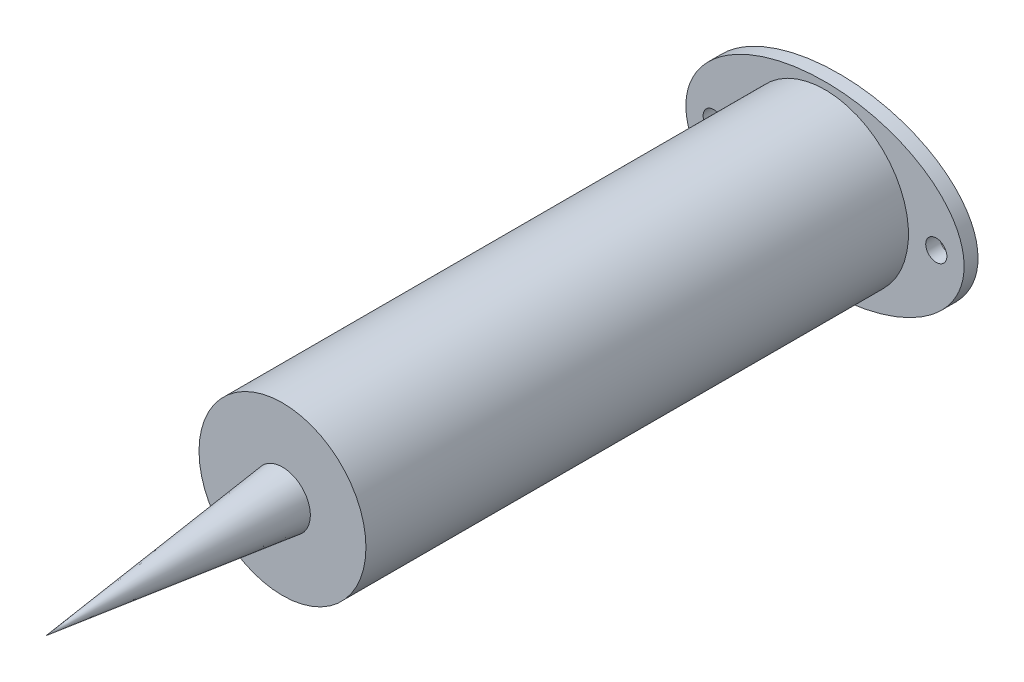
ISO-10303-21;
HEADER;
FILE_DESCRIPTION(('STEP AP214'),'2;1');
FILE_NAME('part.step','',(''),(''),'','','');
FILE_SCHEMA(('AUTOMOTIVE_DESIGN { 1 0 10303 214 1 1 1 1 }'));
ENDSEC;
DATA;
#1=APPLICATION_CONTEXT('core data for automotive mechanical design processes');
#2=APPLICATION_PROTOCOL_DEFINITION('international standard','automotive_design',2000,#1);
#3=PRODUCT_CONTEXT('',#1,'mechanical');
#4=PRODUCT('Part','Part','',(#3));
#5=PRODUCT_RELATED_PRODUCT_CATEGORY('part','',(#4));
#6=PRODUCT_DEFINITION_FORMATION('','',#4);
#7=PRODUCT_DEFINITION_CONTEXT('part definition',#1,'design');
#8=PRODUCT_DEFINITION('design','',#6,#7);
#9=PRODUCT_DEFINITION_SHAPE('','',#8);
#10=(LENGTH_UNIT() NAMED_UNIT(*) SI_UNIT(.MILLI.,.METRE.));
#11=(NAMED_UNIT(*) PLANE_ANGLE_UNIT() SI_UNIT($,.RADIAN.));
#12=(NAMED_UNIT(*) SI_UNIT($,.STERADIAN.) SOLID_ANGLE_UNIT());
#13=UNCERTAINTY_MEASURE_WITH_UNIT(LENGTH_MEASURE(1.E-05),#10,'distance_accuracy_value','');
#14=(GEOMETRIC_REPRESENTATION_CONTEXT(3) GLOBAL_UNCERTAINTY_ASSIGNED_CONTEXT((#13)) GLOBAL_UNIT_ASSIGNED_CONTEXT((#10,
#11,#12)) REPRESENTATION_CONTEXT('',''));
#15=CARTESIAN_POINT('',(0.,0.,0.));
#16=DIRECTION('',(0.,0.,1.));
#17=DIRECTION('',(1.,0.,0.));
#18=AXIS2_PLACEMENT_3D('',#15,#16,#17);
#19=CARTESIAN_POINT('',(0.,0.,123.825));
#20=DIRECTION('',(0.,0.,1.));
#21=DIRECTION('',(1.,0.,0.));
#22=AXIS2_PLACEMENT_3D('',#19,#20,#21);
#23=PLANE('',#22);
#24=CARTESIAN_POINT('',(0.,0.,123.825));
#25=DIRECTION('',(0.,0.,1.));
#26=DIRECTION('',(1.,0.,0.));
#27=AXIS2_PLACEMENT_3D('',#24,#25,#26);
#28=CIRCLE('',#27,19.05);
#29=CARTESIAN_POINT('',(19.05,0.,123.825));
#30=VERTEX_POINT('',#29);
#31=EDGE_CURVE('E11',#30,#30,#28,.T.);
#32=ORIENTED_EDGE('',*,*,#31,.T.);
#33=EDGE_LOOP('',(#32));
#34=FACE_BOUND('',#33,.T.);
#35=CARTESIAN_POINT('',(0.,0.,123.825));
#36=DIRECTION('',(0.,0.,-1.));
#37=DIRECTION('',(-1.,0.,0.));
#38=AXIS2_PLACEMENT_3D('',#35,#36,#37);
#39=CIRCLE('',#38,6.35000000000001);
#40=CARTESIAN_POINT('',(-6.35000000000001,0.,123.825));
#41=VERTEX_POINT('',#40);
#42=EDGE_CURVE('E119',#41,#41,#39,.T.);
#43=ORIENTED_EDGE('',*,*,#42,.T.);
#44=EDGE_LOOP('',(#43));
#45=FACE_BOUND('',#44,.T.);
#46=ADVANCED_FACE('F33',(#34,#45),#23,.T.);
#47=CARTESIAN_POINT('',(0.,0.,123.825));
#48=DIRECTION('',(0.,0.,-1.));
#49=DIRECTION('',(-1.,0.,0.));
#50=AXIS2_PLACEMENT_3D('',#47,#48,#49);
#51=CYLINDRICAL_SURFACE('',#50,17.4625);
#52=CARTESIAN_POINT('',(0.,0.,-3.175));
#53=DIRECTION('',(0.,0.,-1.));
#54=DIRECTION('',(-1.,0.,0.));
#55=AXIS2_PLACEMENT_3D('',#52,#53,#54);
#56=CIRCLE('',#55,17.4625);
#57=CARTESIAN_POINT('',(-17.4625,0.,-3.175));
#58=VERTEX_POINT('',#57);
#59=EDGE_CURVE('E80',#58,#58,#56,.T.);
#60=ORIENTED_EDGE('',*,*,#59,.T.);
#61=EDGE_LOOP('',(#60));
#62=FACE_BOUND('',#61,.T.);
#63=CARTESIAN_POINT('',(0.,0.,118.872));
#64=DIRECTION('',(0.,0.,1.));
#65=DIRECTION('',(1.,0.,0.));
#66=AXIS2_PLACEMENT_3D('',#63,#64,#65);
#67=CIRCLE('',#66,17.4625);
#68=CARTESIAN_POINT('',(17.4625,0.,118.872));
#69=VERTEX_POINT('',#68);
#70=EDGE_CURVE('E115',#69,#69,#67,.T.);
#71=ORIENTED_EDGE('',*,*,#70,.T.);
#72=EDGE_LOOP('',(#71));
#73=FACE_BOUND('',#72,.T.);
#74=ADVANCED_FACE('F56',(#62,#73),#51,.F.);
#75=CARTESIAN_POINT('',(0.,0.,123.825));
#76=DIRECTION('',(0.,0.,-1.));
#77=DIRECTION('',(-1.,0.,0.));
#78=AXIS2_PLACEMENT_3D('',#75,#76,#77);
#79=CYLINDRICAL_SURFACE('',#78,19.05);
#80=ORIENTED_EDGE('',*,*,#31,.F.);
#81=EDGE_LOOP('',(#80));
#82=FACE_BOUND('',#81,.T.);
#83=CARTESIAN_POINT('',(0.,0.,0.));
#84=DIRECTION('',(0.,0.,-1.));
#85=DIRECTION('',(-1.,0.,0.));
#86=AXIS2_PLACEMENT_3D('',#83,#84,#85);
#87=CIRCLE('',#86,19.05);
#88=CARTESIAN_POINT('',(-19.05,0.,0.));
#89=VERTEX_POINT('',#88);
#90=EDGE_CURVE('E40',#89,#89,#87,.T.);
#91=ORIENTED_EDGE('',*,*,#90,.F.);
#92=EDGE_LOOP('',(#91));
#93=FACE_BOUND('',#92,.T.);
#94=ADVANCED_FACE('F35',(#82,#93),#79,.T.);
#95=CARTESIAN_POINT('',(0.,0.,0.));
#96=DIRECTION('',(0.,0.,-1.));
#97=DIRECTION('',(-1.,0.,0.));
#98=AXIS2_PLACEMENT_3D('',#95,#96,#97);
#99=PLANE('',#98);
#100=CARTESIAN_POINT('',(25.4,0.,0.));
#101=DIRECTION('',(0.,0.,-1.));
#102=DIRECTION('',(-1.,0.,0.));
#103=AXIS2_PLACEMENT_3D('',#100,#101,#102);
#104=CIRCLE('',#103,2.413);
#105=CARTESIAN_POINT('',(22.987,0.,0.));
#106=VERTEX_POINT('',#105);
#107=EDGE_CURVE('E101',#106,#106,#104,.T.);
#108=ORIENTED_EDGE('',*,*,#107,.T.);
#109=EDGE_LOOP('',(#108));
#110=FACE_BOUND('',#109,.T.);
#111=CARTESIAN_POINT('',(0.,0.,0.));
#112=DIRECTION('',(0.,0.,-1.));
#113=DIRECTION('',(-1.,0.,0.));
#114=AXIS2_PLACEMENT_3D('',#111,#112,#113);
#115=ELLIPSE('',#114,31.75,20.6375);
#116=CARTESIAN_POINT('',(-31.75,0.,0.));
#117=VERTEX_POINT('',#116);
#118=EDGE_CURVE('E79',#117,#117,#115,.T.);
#119=ORIENTED_EDGE('',*,*,#118,.F.);
#120=EDGE_LOOP('',(#119));
#121=FACE_BOUND('',#120,.T.);
#122=CARTESIAN_POINT('',(-25.4,0.,0.));
#123=DIRECTION('',(0.,0.,-1.));
#124=DIRECTION('',(-1.,0.,0.));
#125=AXIS2_PLACEMENT_3D('',#122,#123,#124);
#126=CIRCLE('',#125,2.413);
#127=CARTESIAN_POINT('',(-27.813,0.,0.));
#128=VERTEX_POINT('',#127);
#129=EDGE_CURVE('E106',#128,#128,#126,.T.);
#130=ORIENTED_EDGE('',*,*,#129,.T.);
#131=EDGE_LOOP('',(#130));
#132=FACE_BOUND('',#131,.T.);
#133=ORIENTED_EDGE('',*,*,#90,.T.);
#134=EDGE_LOOP('',(#133));
#135=FACE_BOUND('',#134,.T.);
#136=ADVANCED_FACE('F72',(#110,#121,#132,#135),#99,.F.);
#137=CARTESIAN_POINT('',(0.,0.,-3.175));
#138=DIRECTION('',(0.,0.,-1.));
#139=DIRECTION('',(-1.,0.,0.));
#140=AXIS2_PLACEMENT_3D('',#137,#138,#139);
#141=PLANE('',#140);
#142=CARTESIAN_POINT('',(-25.4,0.,-3.175));
#143=DIRECTION('',(0.,0.,-1.));
#144=DIRECTION('',(-1.,0.,0.));
#145=AXIS2_PLACEMENT_3D('',#142,#143,#144);
#146=CIRCLE('',#145,2.413);
#147=CARTESIAN_POINT('',(-27.813,0.,-3.175));
#148=VERTEX_POINT('',#147);
#149=EDGE_CURVE('E108',#148,#148,#146,.T.);
#150=ORIENTED_EDGE('',*,*,#149,.F.);
#151=EDGE_LOOP('',(#150));
#152=FACE_BOUND('',#151,.T.);
#153=CARTESIAN_POINT('',(0.,0.,-3.175));
#154=DIRECTION('',(0.,0.,-1.));
#155=DIRECTION('',(-1.,0.,0.));
#156=AXIS2_PLACEMENT_3D('',#153,#154,#155);
#157=ELLIPSE('',#156,31.75,20.6375);
#158=CARTESIAN_POINT('',(-31.75,0.,-3.175));
#159=VERTEX_POINT('',#158);
#160=EDGE_CURVE('E74',#159,#159,#157,.T.);
#161=ORIENTED_EDGE('',*,*,#160,.T.);
#162=EDGE_LOOP('',(#161));
#163=FACE_BOUND('',#162,.T.);
#164=ORIENTED_EDGE('',*,*,#59,.F.);
#165=EDGE_LOOP('',(#164));
#166=FACE_BOUND('',#165,.T.);
#167=CARTESIAN_POINT('',(25.4,0.,-3.175));
#168=DIRECTION('',(0.,0.,-1.));
#169=DIRECTION('',(-1.,0.,0.));
#170=AXIS2_PLACEMENT_3D('',#167,#168,#169);
#171=CIRCLE('',#170,2.413);
#172=CARTESIAN_POINT('',(22.987,0.,-3.175));
#173=VERTEX_POINT('',#172);
#174=EDGE_CURVE('E109',#173,#173,#171,.T.);
#175=ORIENTED_EDGE('',*,*,#174,.F.);
#176=EDGE_LOOP('',(#175));
#177=FACE_BOUND('',#176,.T.);
#178=ADVANCED_FACE('F70',(#152,#163,#166,#177),#141,.T.);
#179=DIRECTION('',(0.,0.,1.));
#180=VECTOR('',#179,1.);
#181=SURFACE_OF_LINEAR_EXTRUSION('',#157,#180);
#182=ORIENTED_EDGE('',*,*,#160,.F.);
#183=EDGE_LOOP('',(#182));
#184=FACE_BOUND('',#183,.T.);
#185=ORIENTED_EDGE('',*,*,#118,.T.);
#186=EDGE_LOOP('',(#185));
#187=FACE_BOUND('',#186,.T.);
#188=ADVANCED_FACE('F65',(#184,#187),#181,.F.);
#189=CARTESIAN_POINT('',(-25.4,0.,-3.175));
#190=DIRECTION('',(0.,0.,1.));
#191=DIRECTION('',(1.,0.,0.));
#192=AXIS2_PLACEMENT_3D('',#189,#190,#191);
#193=CYLINDRICAL_SURFACE('',#192,2.413);
#194=ORIENTED_EDGE('',*,*,#149,.T.);
#195=EDGE_LOOP('',(#194));
#196=FACE_BOUND('',#195,.T.);
#197=ORIENTED_EDGE('',*,*,#129,.F.);
#198=EDGE_LOOP('',(#197));
#199=FACE_BOUND('',#198,.T.);
#200=ADVANCED_FACE('F69',(#196,#199),#193,.F.);
#201=CARTESIAN_POINT('',(25.4,0.,-3.175));
#202=DIRECTION('',(0.,0.,1.));
#203=DIRECTION('',(1.,0.,0.));
#204=AXIS2_PLACEMENT_3D('',#201,#202,#203);
#205=CYLINDRICAL_SURFACE('',#204,2.413);
#206=ORIENTED_EDGE('',*,*,#174,.T.);
#207=EDGE_LOOP('',(#206));
#208=FACE_BOUND('',#207,.T.);
#209=ORIENTED_EDGE('',*,*,#107,.F.);
#210=EDGE_LOOP('',(#209));
#211=FACE_BOUND('',#210,.T.);
#212=ADVANCED_FACE('F51',(#208,#211),#205,.F.);
#213=CARTESIAN_POINT('',(0.,0.,118.872));
#214=DIRECTION('',(0.,0.,1.));
#215=DIRECTION('',(1.,0.,0.));
#216=AXIS2_PLACEMENT_3D('',#213,#214,#215);
#217=PLANE('',#216);
#218=ORIENTED_EDGE('',*,*,#70,.F.);
#219=EDGE_LOOP('',(#218));
#220=FACE_BOUND('',#219,.T.);
#221=ADVANCED_FACE('F45',(#220),#217,.F.);
#222=CARTESIAN_POINT('',(0.,0.,177.8));
#223=DIRECTION('',(0.,0.,-1.));
#224=DIRECTION('',(-1.,0.,0.));
#225=AXIS2_PLACEMENT_3D('',#222,#223,#224);
#226=CONICAL_SURFACE('',#225,0.,0.117108744566864);
#227=ORIENTED_EDGE('',*,*,#42,.F.);
#228=EDGE_LOOP('',(#227));
#229=FACE_BOUND('',#228,.T.);
#230=CARTESIAN_POINT('',(0.,0.,177.8));
#231=VERTEX_POINT('',#230);
#232=VERTEX_LOOP('',#231);
#233=FACE_BOUND('',#232,.T.);
#234=ADVANCED_FACE('F43',(#229,#233),#226,.T.);
#235=CLOSED_SHELL('',(#46,#74,#94,#136,#178,#188,#200,#212,#221,#234));
#236=MANIFOLD_SOLID_BREP('B2',#235);
#237=ADVANCED_BREP_SHAPE_REPRESENTATION('',(#18,#236),#14);
#238=SHAPE_DEFINITION_REPRESENTATION(#9,#237);
ENDSEC;
END-ISO-10303-21;
